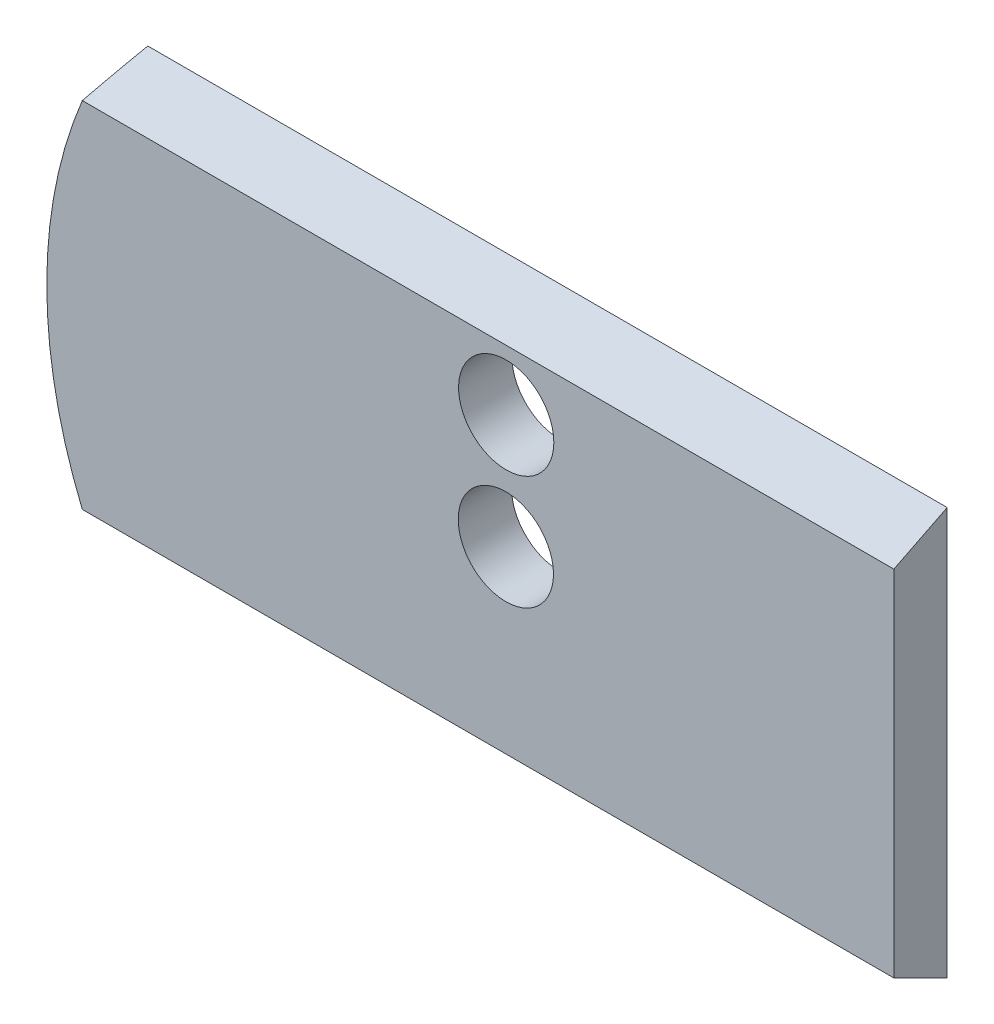
ISO-10303-21;
HEADER;
FILE_DESCRIPTION(('STEP AP214'),'2;1');
FILE_NAME('part.step','',(''),(''),'','','');
FILE_SCHEMA(('AUTOMOTIVE_DESIGN { 1 0 10303 214 1 1 1 1 }'));
ENDSEC;
DATA;
#1=APPLICATION_CONTEXT('core data for automotive mechanical design processes');
#2=APPLICATION_PROTOCOL_DEFINITION('international standard','automotive_design',2000,#1);
#3=PRODUCT_CONTEXT('',#1,'mechanical');
#4=PRODUCT('Part','Part','',(#3));
#5=PRODUCT_RELATED_PRODUCT_CATEGORY('part','',(#4));
#6=PRODUCT_DEFINITION_FORMATION('','',#4);
#7=PRODUCT_DEFINITION_CONTEXT('part definition',#1,'design');
#8=PRODUCT_DEFINITION('design','',#6,#7);
#9=PRODUCT_DEFINITION_SHAPE('','',#8);
#10=(LENGTH_UNIT() NAMED_UNIT(*) SI_UNIT(.MILLI.,.METRE.));
#11=(NAMED_UNIT(*) PLANE_ANGLE_UNIT() SI_UNIT($,.RADIAN.));
#12=(NAMED_UNIT(*) SI_UNIT($,.STERADIAN.) SOLID_ANGLE_UNIT());
#13=UNCERTAINTY_MEASURE_WITH_UNIT(LENGTH_MEASURE(1.E-05),#10,'distance_accuracy_value','');
#14=(GEOMETRIC_REPRESENTATION_CONTEXT(3) GLOBAL_UNCERTAINTY_ASSIGNED_CONTEXT((#13)) GLOBAL_UNIT_ASSIGNED_CONTEXT((#10,
#11,#12)) REPRESENTATION_CONTEXT('',''));
#15=CARTESIAN_POINT('',(0.,0.,0.));
#16=DIRECTION('',(0.,0.,1.));
#17=DIRECTION('',(1.,0.,0.));
#18=AXIS2_PLACEMENT_3D('',#15,#16,#17);
#19=CARTESIAN_POINT('',(20.4100763328063,9.29468259645733,5.4));
#20=DIRECTION('',(0.,0.,-1.));
#21=DIRECTION('',(0.,1.,0.));
#22=AXIS2_PLACEMENT_3D('',#19,#20,#21);
#23=PLANE('',#22);
#24=CARTESIAN_POINT('',(0.0362014860193008,0.,5.4));
#25=DIRECTION('',(0.,0.,-1.));
#26=DIRECTION('',(1.,0.,0.));
#27=AXIS2_PLACEMENT_3D('',#24,#25,#26);
#28=CIRCLE('',#27,24.0964342056803);
#29=CARTESIAN_POINT('',(-22.1954654973582,-9.29468259645733,5.4));
#30=VERTEX_POINT('',#29);
#31=CARTESIAN_POINT('',(-22.1954654973582,9.29468259645733,5.4));
#32=VERTEX_POINT('',#31);
#33=EDGE_CURVE('E83',#30,#32,#28,.T.);
#34=ORIENTED_EDGE('',*,*,#33,.F.);
#35=DIRECTION('',(-1.,0.,0.));
#36=VECTOR('',#35,1.);
#37=CARTESIAN_POINT('',(20.4100763328063,-9.29468259645733,5.4));
#38=LINE('',#37,#36);
#39=CARTESIAN_POINT('',(20.4100763328063,-9.29468259645733,5.4));
#40=VERTEX_POINT('',#39);
#41=EDGE_CURVE('E87',#40,#30,#38,.T.);
#42=ORIENTED_EDGE('',*,*,#41,.F.);
#43=DIRECTION('',(0.,-1.,0.));
#44=VECTOR('',#43,1.);
#45=CARTESIAN_POINT('',(20.4100763328063,9.29468259645733,5.4));
#46=LINE('',#45,#44);
#47=CARTESIAN_POINT('',(20.4100763328063,9.29468259645733,5.4));
#48=VERTEX_POINT('',#47);
#49=EDGE_CURVE('E180',#48,#40,#46,.T.);
#50=ORIENTED_EDGE('',*,*,#49,.F.);
#51=DIRECTION('',(-1.,0.,0.));
#52=VECTOR('',#51,1.);
#53=CARTESIAN_POINT('',(20.4100763328063,9.29468259645733,5.4));
#54=LINE('',#53,#52);
#55=EDGE_CURVE('E90',#48,#32,#54,.T.);
#56=ORIENTED_EDGE('',*,*,#55,.T.);
#57=EDGE_LOOP('',(#34,#42,#50,#56));
#58=FACE_BOUND('',#57,.T.);
#59=CARTESIAN_POINT('',(0.040251578155195,0.129406292059166,5.400012));
#60=DIRECTION('',(0.,0.,1.));
#61=DIRECTION('',(1.,0.,0.));
#62=AXIS2_PLACEMENT_3D('',#59,#60,#61);
#63=CIRCLE('',#62,2.5);
#64=CARTESIAN_POINT('',(2.54025157815519,0.129406292059167,5.400012));
#65=VERTEX_POINT('',#64);
#66=EDGE_CURVE('E120',#65,#65,#63,.T.);
#67=ORIENTED_EDGE('',*,*,#66,.F.);
#68=EDGE_LOOP('',(#67));
#69=FACE_BOUND('',#68,.T.);
#70=CARTESIAN_POINT('',(0.058702660123422,6.12941125518829,5.400012));
#71=DIRECTION('',(0.,0.,1.));
#72=DIRECTION('',(1.,0.,0.));
#73=AXIS2_PLACEMENT_3D('',#70,#71,#72);
#74=CIRCLE('',#73,2.5);
#75=CARTESIAN_POINT('',(2.55870266012342,6.12941125518829,5.400012));
#76=VERTEX_POINT('',#75);
#77=EDGE_CURVE('E91',#76,#76,#74,.T.);
#78=ORIENTED_EDGE('',*,*,#77,.F.);
#79=EDGE_LOOP('',(#78));
#80=FACE_BOUND('',#79,.T.);
#81=ADVANCED_FACE('F39',(#58,#69,#80),#23,.F.);
#82=CARTESIAN_POINT('',(20.4100763328063,9.29468259645733,5.4));
#83=DIRECTION('',(0.,-0.894427190999916,-0.447213595499958));
#84=DIRECTION('',(0.,0.447213595499958,-0.894427190999916));
#85=AXIS2_PLACEMENT_3D('',#82,#83,#84);
#86=PLANE('',#85);
#87=CARTESIAN_POINT('',(0.0362014860193008,0.,23.9893651929146));
#88=DIRECTION('',(0.,-0.894427190999916,-0.447213595499958));
#89=DIRECTION('',(0.,0.447213595499958,-0.894427190999916));
#90=AXIS2_PLACEMENT_3D('',#87,#88,#89);
#91=ELLIPSE('',#90,53.8812648992524,24.0964342056803);
#92=CARTESIAN_POINT('',(-21.5568970778671,10.6946825964573,2.6));
#93=VERTEX_POINT('',#92);
#94=EDGE_CURVE('E174',#32,#93,#91,.T.);
#95=ORIENTED_EDGE('',*,*,#94,.F.);
#96=ORIENTED_EDGE('',*,*,#55,.F.);
#97=DIRECTION('',(0.,-0.447213595499958,0.894427190999916));
#98=VECTOR('',#97,1.);
#99=CARTESIAN_POINT('',(20.4100763328063,9.29468259645733,5.4));
#100=LINE('',#99,#98);
#101=CARTESIAN_POINT('',(20.4100763328063,10.6946825964573,2.6));
#102=VERTEX_POINT('',#101);
#103=EDGE_CURVE('E173',#102,#48,#100,.T.);
#104=ORIENTED_EDGE('',*,*,#103,.F.);
#105=DIRECTION('',(-1.,0.,0.));
#106=VECTOR('',#105,1.);
#107=CARTESIAN_POINT('',(20.4100763328063,10.6946825964573,2.6));
#108=LINE('',#107,#106);
#109=EDGE_CURVE('E110',#102,#93,#108,.T.);
#110=ORIENTED_EDGE('',*,*,#109,.T.);
#111=EDGE_LOOP('',(#95,#96,#104,#110));
#112=FACE_BOUND('',#111,.T.);
#113=ADVANCED_FACE('F41',(#112),#86,.F.);
#114=CARTESIAN_POINT('',(20.4100763328063,-10.6946825964573,2.6));
#115=DIRECTION('',(0.,0.894427190999916,-0.447213595499957));
#116=DIRECTION('',(0.,0.447213595499958,0.894427190999916));
#117=AXIS2_PLACEMENT_3D('',#114,#115,#116);
#118=PLANE('',#117);
#119=CARTESIAN_POINT('',(0.0362014860193008,0.,23.9893651929147));
#120=DIRECTION('',(0.,0.894427190999916,-0.447213595499957));
#121=DIRECTION('',(0.,-0.447213595499958,-0.894427190999916));
#122=AXIS2_PLACEMENT_3D('',#119,#120,#121);
#123=ELLIPSE('',#122,53.8812648992525,24.0964342056803);
#124=CARTESIAN_POINT('',(-21.5568970778671,-10.6946825964573,2.6));
#125=VERTEX_POINT('',#124);
#126=EDGE_CURVE('E95',#125,#30,#123,.T.);
#127=ORIENTED_EDGE('',*,*,#126,.F.);
#128=DIRECTION('',(-1.,0.,0.));
#129=VECTOR('',#128,1.);
#130=CARTESIAN_POINT('',(20.4100763328063,-10.6946825964573,2.6));
#131=LINE('',#130,#129);
#132=CARTESIAN_POINT('',(20.4100763328063,-10.6946825964573,2.6));
#133=VERTEX_POINT('',#132);
#134=EDGE_CURVE('E103',#133,#125,#131,.T.);
#135=ORIENTED_EDGE('',*,*,#134,.F.);
#136=DIRECTION('',(0.,-0.447213595499957,-0.894427190999916));
#137=VECTOR('',#136,1.);
#138=CARTESIAN_POINT('',(20.4100763328063,-10.6946825964573,2.6));
#139=LINE('',#138,#137);
#140=EDGE_CURVE('E64',#40,#133,#139,.T.);
#141=ORIENTED_EDGE('',*,*,#140,.F.);
#142=ORIENTED_EDGE('',*,*,#41,.T.);
#143=EDGE_LOOP('',(#127,#135,#141,#142));
#144=FACE_BOUND('',#143,.T.);
#145=ADVANCED_FACE('F105',(#144),#118,.F.);
#146=CARTESIAN_POINT('',(20.4100763328063,10.6946825964573,2.6));
#147=DIRECTION('',(0.,0.,1.));
#148=DIRECTION('',(0.,-1.,0.));
#149=AXIS2_PLACEMENT_3D('',#146,#147,#148);
#150=PLANE('',#149);
#151=CARTESIAN_POINT('',(0.058702660123422,6.12941125518829,2.6));
#152=DIRECTION('',(0.,0.,1.));
#153=DIRECTION('',(0.,-1.,0.));
#154=AXIS2_PLACEMENT_3D('',#151,#152,#153);
#155=CIRCLE('',#154,2.5);
#156=CARTESIAN_POINT('',(0.058702660123422,3.62941125518829,2.6));
#157=VERTEX_POINT('',#156);
#158=EDGE_CURVE('E247',#157,#157,#155,.F.);
#159=ORIENTED_EDGE('',*,*,#158,.F.);
#160=EDGE_LOOP('',(#159));
#161=FACE_BOUND('',#160,.T.);
#162=CARTESIAN_POINT('',(0.040251578155195,0.129406292059166,2.6));
#163=DIRECTION('',(0.,0.,1.));
#164=DIRECTION('',(0.,-1.,0.));
#165=AXIS2_PLACEMENT_3D('',#162,#163,#164);
#166=CIRCLE('',#165,2.5);
#167=CARTESIAN_POINT('',(0.040251578155195,-2.37059370794083,2.6));
#168=VERTEX_POINT('',#167);
#169=EDGE_CURVE('E249',#168,#168,#166,.F.);
#170=ORIENTED_EDGE('',*,*,#169,.F.);
#171=EDGE_LOOP('',(#170));
#172=FACE_BOUND('',#171,.T.);
#173=CARTESIAN_POINT('',(-20.1860501069981,-8.79149318261138,2.6));
#174=DIRECTION('',(0.,0.,1.));
#175=DIRECTION('',(0.,-1.,0.));
#176=AXIS2_PLACEMENT_3D('',#173,#174,#175);
#177=CIRCLE('',#176,0.75);
#178=CARTESIAN_POINT('',(-20.1860501069981,-9.54149318261138,2.6));
#179=VERTEX_POINT('',#178);
#180=EDGE_CURVE('E11',#179,#179,#177,.F.);
#181=ORIENTED_EDGE('',*,*,#180,.F.);
#182=EDGE_LOOP('',(#181));
#183=FACE_BOUND('',#182,.T.);
#184=CARTESIAN_POINT('',(-22.0938968943912,-0.0644523273295901,2.6));
#185=DIRECTION('',(0.,0.,1.));
#186=DIRECTION('',(0.,-1.,0.));
#187=AXIS2_PLACEMENT_3D('',#184,#185,#186);
#188=CIRCLE('',#187,0.75);
#189=CARTESIAN_POINT('',(-22.0938968943912,-0.81445232732959,2.6));
#190=VERTEX_POINT('',#189);
#191=EDGE_CURVE('E47',#190,#190,#188,.F.);
#192=ORIENTED_EDGE('',*,*,#191,.F.);
#193=EDGE_LOOP('',(#192));
#194=FACE_BOUND('',#193,.T.);
#195=CARTESIAN_POINT('',(-20.2538097774265,8.6771265263961,2.6));
#196=DIRECTION('',(0.,0.,1.));
#197=DIRECTION('',(0.,-1.,0.));
#198=AXIS2_PLACEMENT_3D('',#195,#196,#197);
#199=CIRCLE('',#198,0.75);
#200=CARTESIAN_POINT('',(-20.2538097774265,7.9271265263961,2.6));
#201=VERTEX_POINT('',#200);
#202=EDGE_CURVE('E104',#201,#201,#199,.F.);
#203=ORIENTED_EDGE('',*,*,#202,.F.);
#204=EDGE_LOOP('',(#203));
#205=FACE_BOUND('',#204,.T.);
#206=CARTESIAN_POINT('',(0.0362014860193008,0.,2.6));
#207=DIRECTION('',(0.,0.,1.));
#208=DIRECTION('',(0.,-1.,0.));
#209=AXIS2_PLACEMENT_3D('',#206,#207,#208);
#210=CIRCLE('',#209,24.0964342056803);
#211=EDGE_CURVE('E98',#93,#125,#210,.T.);
#212=ORIENTED_EDGE('',*,*,#211,.F.);
#213=ORIENTED_EDGE('',*,*,#109,.F.);
#214=DIRECTION('',(0.,1.,0.));
#215=VECTOR('',#214,1.);
#216=CARTESIAN_POINT('',(20.4100763328063,10.6946825964573,2.6));
#217=LINE('',#216,#215);
#218=EDGE_CURVE('E60',#133,#102,#217,.T.);
#219=ORIENTED_EDGE('',*,*,#218,.F.);
#220=ORIENTED_EDGE('',*,*,#134,.T.);
#221=EDGE_LOOP('',(#212,#213,#219,#220));
#222=FACE_BOUND('',#221,.T.);
#223=ADVANCED_FACE('F135',(#161,#172,#183,#194,#205,#222),#150,.F.);
#224=CARTESIAN_POINT('',(20.4100763328063,0.,0.));
#225=DIRECTION('',(-1.,0.,0.));
#226=DIRECTION('',(0.,0.,1.));
#227=AXIS2_PLACEMENT_3D('',#224,#225,#226);
#228=PLANE('',#227);
#229=ORIENTED_EDGE('',*,*,#103,.T.);
#230=ORIENTED_EDGE('',*,*,#49,.T.);
#231=ORIENTED_EDGE('',*,*,#140,.T.);
#232=ORIENTED_EDGE('',*,*,#218,.T.);
#233=EDGE_LOOP('',(#229,#230,#231,#232));
#234=FACE_BOUND('',#233,.T.);
#235=ADVANCED_FACE('F136',(#234),#228,.F.);
#236=CARTESIAN_POINT('',(0.0362014860193008,0.,2.6));
#237=DIRECTION('',(0.,0.,-1.));
#238=DIRECTION('',(-1.,0.,0.));
#239=AXIS2_PLACEMENT_3D('',#236,#237,#238);
#240=CYLINDRICAL_SURFACE('',#239,24.0964342056803);
#241=ORIENTED_EDGE('',*,*,#94,.T.);
#242=ORIENTED_EDGE('',*,*,#211,.T.);
#243=ORIENTED_EDGE('',*,*,#126,.T.);
#244=ORIENTED_EDGE('',*,*,#33,.T.);
#245=EDGE_LOOP('',(#241,#242,#243,#244));
#246=FACE_BOUND('',#245,.T.);
#247=ADVANCED_FACE('F96',(#246),#240,.T.);
#248=CARTESIAN_POINT('',(-20.2538097774265,8.6771265263961,2.6));
#249=DIRECTION('',(0.,1.,0.));
#250=DIRECTION('',(1.,0.,0.));
#251=AXIS2_PLACEMENT_3D('',#248,#249,#250);
#252=SPHERICAL_SURFACE('',#251,0.75);
#253=CARTESIAN_POINT('',(-20.2538097774265,8.6771265263961,2.6));
#254=DIRECTION('',(0.,0.,1.));
#255=DIRECTION('',(0.,-1.,0.));
#256=AXIS2_PLACEMENT_3D('',#253,#254,#255);
#257=SPHERICAL_SURFACE('',#256,0.75);
#258=ORIENTED_EDGE('',*,*,#202,.T.);
#259=EDGE_LOOP('',(#258));
#260=FACE_BOUND('',#259,.T.);
#261=ADVANCED_FACE('F142',(#260),#257,.T.);
#262=CARTESIAN_POINT('',(-22.0938968943912,-0.0644523273295901,2.6));
#263=DIRECTION('',(-0.410221159595526,0.911986074575759,0.));
#264=DIRECTION('',(0.911986074575759,0.410221159595526,0.));
#265=AXIS2_PLACEMENT_3D('',#262,#263,#264);
#266=SPHERICAL_SURFACE('',#265,0.75);
#267=CARTESIAN_POINT('',(-22.0938968943912,-0.0644523273295901,2.6));
#268=DIRECTION('',(0.,0.,1.));
#269=DIRECTION('',(0.,-1.,0.));
#270=AXIS2_PLACEMENT_3D('',#267,#268,#269);
#271=SPHERICAL_SURFACE('',#270,0.75);
#272=ORIENTED_EDGE('',*,*,#191,.T.);
#273=EDGE_LOOP('',(#272));
#274=FACE_BOUND('',#273,.T.);
#275=ADVANCED_FACE('F144',(#274),#271,.T.);
#276=CARTESIAN_POINT('',(-20.1860501069981,-8.79149318261138,2.6));
#277=DIRECTION('',(-0.74823197009489,0.663437200440192,0.));
#278=DIRECTION('',(0.663437200440192,0.74823197009489,0.));
#279=AXIS2_PLACEMENT_3D('',#276,#277,#278);
#280=SPHERICAL_SURFACE('',#279,0.75);
#281=CARTESIAN_POINT('',(-20.1860501069981,-8.79149318261138,2.6));
#282=DIRECTION('',(0.,0.,1.));
#283=DIRECTION('',(0.,-1.,0.));
#284=AXIS2_PLACEMENT_3D('',#281,#282,#283);
#285=SPHERICAL_SURFACE('',#284,0.75);
#286=ORIENTED_EDGE('',*,*,#180,.T.);
#287=EDGE_LOOP('',(#286));
#288=FACE_BOUND('',#287,.T.);
#289=ADVANCED_FACE('F149',(#288),#285,.T.);
#290=CARTESIAN_POINT('',(0.040251578155195,0.129406292059166,5.400012));
#291=DIRECTION('',(0.,0.,-1.));
#292=DIRECTION('',(-1.,0.,0.));
#293=AXIS2_PLACEMENT_3D('',#290,#291,#292);
#294=CYLINDRICAL_SURFACE('',#293,2.5);
#295=ORIENTED_EDGE('',*,*,#66,.T.);
#296=EDGE_LOOP('',(#295));
#297=FACE_BOUND('',#296,.T.);
#298=ORIENTED_EDGE('',*,*,#169,.T.);
#299=EDGE_LOOP('',(#298));
#300=FACE_BOUND('',#299,.T.);
#301=ADVANCED_FACE('F153',(#297,#300),#294,.F.);
#302=CARTESIAN_POINT('',(0.058702660123422,6.12941125518829,5.400012));
#303=DIRECTION('',(0.,0.,-1.));
#304=DIRECTION('',(-1.,0.,0.));
#305=AXIS2_PLACEMENT_3D('',#302,#303,#304);
#306=CYLINDRICAL_SURFACE('',#305,2.5);
#307=ORIENTED_EDGE('',*,*,#77,.T.);
#308=EDGE_LOOP('',(#307));
#309=FACE_BOUND('',#308,.T.);
#310=ORIENTED_EDGE('',*,*,#158,.T.);
#311=EDGE_LOOP('',(#310));
#312=FACE_BOUND('',#311,.T.);
#313=ADVANCED_FACE('F158',(#309,#312),#306,.F.);
#314=CLOSED_SHELL('',(#81,#113,#145,#223,#235,#247,#261,#275,#289,#301,#313));
#315=MANIFOLD_SOLID_BREP('B2',#314);
#316=ADVANCED_BREP_SHAPE_REPRESENTATION('',(#18,#315),#14);
#317=SHAPE_DEFINITION_REPRESENTATION(#9,#316);
ENDSEC;
END-ISO-10303-21;
